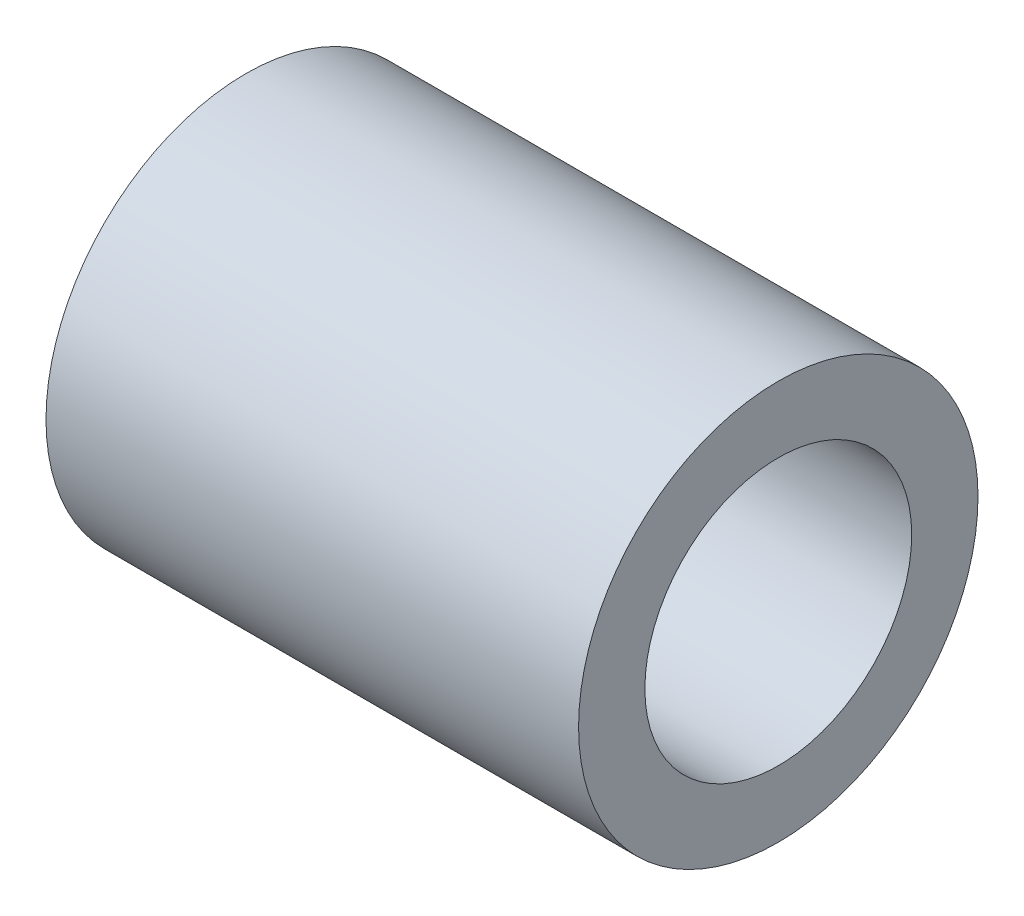
ISO-10303-21;
HEADER;
FILE_DESCRIPTION(('STEP AP214'),'2;1');
FILE_NAME('part.step','',(''),(''),'','','');
FILE_SCHEMA(('AUTOMOTIVE_DESIGN { 1 0 10303 214 1 1 1 1 }'));
ENDSEC;
DATA;
#1=APPLICATION_CONTEXT('core data for automotive mechanical design processes');
#2=APPLICATION_PROTOCOL_DEFINITION('international standard','automotive_design',2000,#1);
#3=PRODUCT_CONTEXT('',#1,'mechanical');
#4=PRODUCT('Part','Part','',(#3));
#5=PRODUCT_RELATED_PRODUCT_CATEGORY('part','',(#4));
#6=PRODUCT_DEFINITION_FORMATION('','',#4);
#7=PRODUCT_DEFINITION_CONTEXT('part definition',#1,'design');
#8=PRODUCT_DEFINITION('design','',#6,#7);
#9=PRODUCT_DEFINITION_SHAPE('','',#8);
#10=(LENGTH_UNIT() NAMED_UNIT(*) SI_UNIT(.MILLI.,.METRE.));
#11=(NAMED_UNIT(*) PLANE_ANGLE_UNIT() SI_UNIT($,.RADIAN.));
#12=(NAMED_UNIT(*) SI_UNIT($,.STERADIAN.) SOLID_ANGLE_UNIT());
#13=UNCERTAINTY_MEASURE_WITH_UNIT(LENGTH_MEASURE(1.E-05),#10,'distance_accuracy_value','');
#14=(GEOMETRIC_REPRESENTATION_CONTEXT(3) GLOBAL_UNCERTAINTY_ASSIGNED_CONTEXT((#13)) GLOBAL_UNIT_ASSIGNED_CONTEXT((#10,
#11,#12)) REPRESENTATION_CONTEXT('',''));
#15=CARTESIAN_POINT('',(0.,0.,0.));
#16=DIRECTION('',(0.,0.,1.));
#17=DIRECTION('',(1.,0.,0.));
#18=AXIS2_PLACEMENT_3D('',#15,#16,#17);
#19=CARTESIAN_POINT('',(25.4,0.,0.));
#20=DIRECTION('',(1.,0.,0.));
#21=DIRECTION('',(0.,0.,-1.));
#22=AXIS2_PLACEMENT_3D('',#19,#20,#21);
#23=PLANE('',#22);
#24=CARTESIAN_POINT('',(25.4,0.,0.));
#25=DIRECTION('',(1.,0.,0.));
#26=DIRECTION('',(0.,0.,-1.));
#27=AXIS2_PLACEMENT_3D('',#24,#25,#26);
#28=CIRCLE('',#27,9.525);
#29=CARTESIAN_POINT('',(25.4,0.,-9.525));
#30=VERTEX_POINT('',#29);
#31=EDGE_CURVE('E10',#30,#30,#28,.T.);
#32=ORIENTED_EDGE('',*,*,#31,.T.);
#33=EDGE_LOOP('',(#32));
#34=FACE_BOUND('',#33,.T.);
#35=CARTESIAN_POINT('',(25.4,0.,0.));
#36=DIRECTION('',(1.,0.,0.));
#37=DIRECTION('',(0.,0.,-1.));
#38=AXIS2_PLACEMENT_3D('',#35,#36,#37);
#39=CIRCLE('',#38,6.3627);
#40=CARTESIAN_POINT('',(25.4,0.,-6.3627));
#41=VERTEX_POINT('',#40);
#42=EDGE_CURVE('E42',#41,#41,#39,.T.);
#43=ORIENTED_EDGE('',*,*,#42,.F.);
#44=EDGE_LOOP('',(#43));
#45=FACE_BOUND('',#44,.T.);
#46=ADVANCED_FACE('F31',(#34,#45),#23,.T.);
#47=CARTESIAN_POINT('',(0.,0.,0.));
#48=DIRECTION('',(1.,0.,0.));
#49=DIRECTION('',(0.,0.,-1.));
#50=AXIS2_PLACEMENT_3D('',#47,#48,#49);
#51=PLANE('',#50);
#52=CARTESIAN_POINT('',(0.,0.,0.));
#53=DIRECTION('',(1.,0.,0.));
#54=DIRECTION('',(0.,0.,-1.));
#55=AXIS2_PLACEMENT_3D('',#52,#53,#54);
#56=CIRCLE('',#55,9.525);
#57=CARTESIAN_POINT('',(0.,0.,-9.525));
#58=VERTEX_POINT('',#57);
#59=EDGE_CURVE('E35',#58,#58,#56,.T.);
#60=ORIENTED_EDGE('',*,*,#59,.F.);
#61=EDGE_LOOP('',(#60));
#62=FACE_BOUND('',#61,.T.);
#63=CARTESIAN_POINT('',(0.,0.,0.));
#64=DIRECTION('',(1.,0.,0.));
#65=DIRECTION('',(0.,0.,-1.));
#66=AXIS2_PLACEMENT_3D('',#63,#64,#65);
#67=CIRCLE('',#66,6.3627);
#68=CARTESIAN_POINT('',(0.,0.,-6.3627));
#69=VERTEX_POINT('',#68);
#70=EDGE_CURVE('E44',#69,#69,#67,.T.);
#71=ORIENTED_EDGE('',*,*,#70,.T.);
#72=EDGE_LOOP('',(#71));
#73=FACE_BOUND('',#72,.T.);
#74=ADVANCED_FACE('F54',(#62,#73),#51,.F.);
#75=CARTESIAN_POINT('',(25.4,0.,0.));
#76=DIRECTION('',(-1.,0.,0.));
#77=DIRECTION('',(0.,0.,1.));
#78=AXIS2_PLACEMENT_3D('',#75,#76,#77);
#79=CYLINDRICAL_SURFACE('',#78,9.525);
#80=ORIENTED_EDGE('',*,*,#31,.F.);
#81=EDGE_LOOP('',(#80));
#82=FACE_BOUND('',#81,.T.);
#83=ORIENTED_EDGE('',*,*,#59,.T.);
#84=EDGE_LOOP('',(#83));
#85=FACE_BOUND('',#84,.T.);
#86=ADVANCED_FACE('F33',(#82,#85),#79,.T.);
#87=CARTESIAN_POINT('',(25.4,0.,0.));
#88=DIRECTION('',(-1.,0.,0.));
#89=DIRECTION('',(0.,0.,1.));
#90=AXIS2_PLACEMENT_3D('',#87,#88,#89);
#91=CYLINDRICAL_SURFACE('',#90,6.3627);
#92=ORIENTED_EDGE('',*,*,#42,.T.);
#93=EDGE_LOOP('',(#92));
#94=FACE_BOUND('',#93,.T.);
#95=ORIENTED_EDGE('',*,*,#70,.F.);
#96=EDGE_LOOP('',(#95));
#97=FACE_BOUND('',#96,.T.);
#98=ADVANCED_FACE('F50',(#94,#97),#91,.F.);
#99=CLOSED_SHELL('',(#46,#74,#86,#98));
#100=MANIFOLD_SOLID_BREP('B2',#99);
#101=ADVANCED_BREP_SHAPE_REPRESENTATION('',(#18,#100),#14);
#102=SHAPE_DEFINITION_REPRESENTATION(#9,#101);
ENDSEC;
END-ISO-10303-21;
